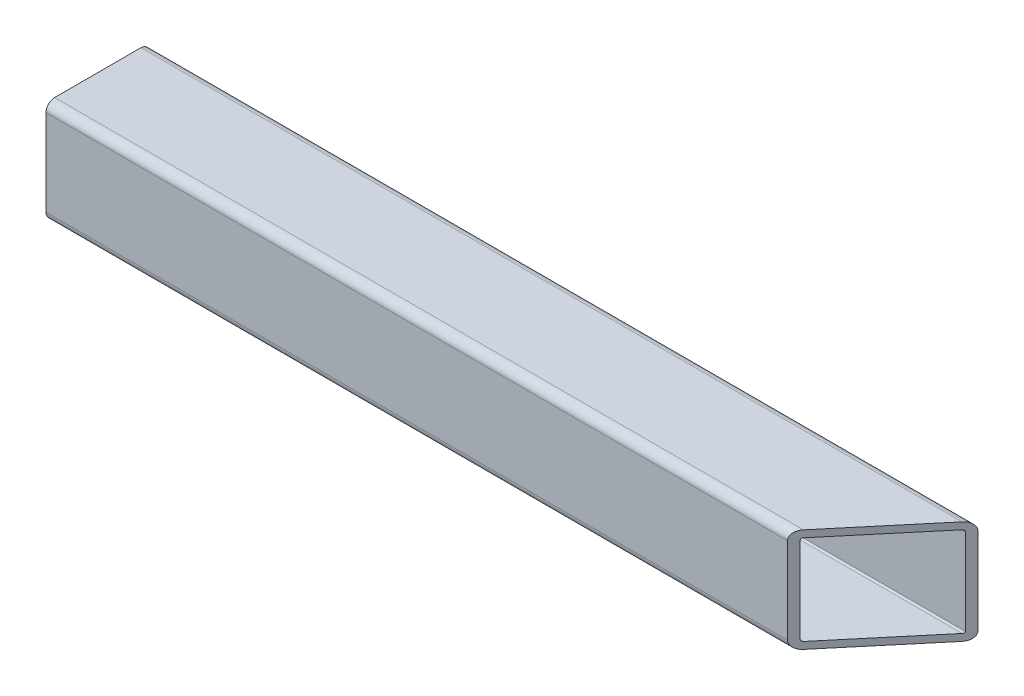
ISO-10303-21;
HEADER;
FILE_DESCRIPTION(('STEP AP214'),'2;1');
FILE_NAME('part.step','',(''),(''),'','','');
FILE_SCHEMA(('AUTOMOTIVE_DESIGN { 1 0 10303 214 1 1 1 1 }'));
ENDSEC;
DATA;
#1=APPLICATION_CONTEXT('core data for automotive mechanical design processes');
#2=APPLICATION_PROTOCOL_DEFINITION('international standard','automotive_design',2000,#1);
#3=PRODUCT_CONTEXT('',#1,'mechanical');
#4=PRODUCT('Part','Part','',(#3));
#5=PRODUCT_RELATED_PRODUCT_CATEGORY('part','',(#4));
#6=PRODUCT_DEFINITION_FORMATION('','',#4);
#7=PRODUCT_DEFINITION_CONTEXT('part definition',#1,'design');
#8=PRODUCT_DEFINITION('design','',#6,#7);
#9=PRODUCT_DEFINITION_SHAPE('','',#8);
#10=(LENGTH_UNIT() NAMED_UNIT(*) SI_UNIT(.MILLI.,.METRE.));
#11=(NAMED_UNIT(*) PLANE_ANGLE_UNIT() SI_UNIT($,.RADIAN.));
#12=(NAMED_UNIT(*) SI_UNIT($,.STERADIAN.) SOLID_ANGLE_UNIT());
#13=UNCERTAINTY_MEASURE_WITH_UNIT(LENGTH_MEASURE(1.E-05),#10,'distance_accuracy_value','');
#14=(GEOMETRIC_REPRESENTATION_CONTEXT(3) GLOBAL_UNCERTAINTY_ASSIGNED_CONTEXT((#13)) GLOBAL_UNIT_ASSIGNED_CONTEXT((#10,
#11,#12)) REPRESENTATION_CONTEXT('',''));
#15=CARTESIAN_POINT('',(0.,0.,0.));
#16=DIRECTION('',(0.,0.,1.));
#17=DIRECTION('',(1.,0.,0.));
#18=AXIS2_PLACEMENT_3D('',#15,#16,#17);
#19=CARTESIAN_POINT('',(152.4,-15.875,15.875));
#20=DIRECTION('',(-1.,0.,0.));
#21=DIRECTION('',(0.,0.,1.));
#22=AXIS2_PLACEMENT_3D('',#19,#20,#21);
#23=CYLINDRICAL_SURFACE('',#22,3.175);
#24=CARTESIAN_POINT('',(123.094445381133,-15.875,15.875));
#25=DIRECTION('',(0.766044443118977,0.,0.642787609686541));
#26=DIRECTION('',(-0.642787609686541,0.,0.766044443118977));
#27=AXIS2_PLACEMENT_3D('',#24,#25,#26);
#28=ELLIPSE('',#27,4.14466814363,3.175);
#29=CARTESIAN_POINT('',(120.430304052146,-15.8749999999999,19.05));
#30=VERTEX_POINT('',#29);
#31=CARTESIAN_POINT('',(123.094445381133,-19.05,15.875));
#32=VERTEX_POINT('',#31);
#33=EDGE_CURVE('E206',#30,#32,#28,.T.);
#34=ORIENTED_EDGE('',*,*,#33,.F.);
#35=DIRECTION('',(-1.,0.,0.));
#36=VECTOR('',#35,1.);
#37=CARTESIAN_POINT('',(152.4,-15.875,19.05));
#38=LINE('',#37,#36);
#39=CARTESIAN_POINT('',(-152.4,-15.875,19.05));
#40=VERTEX_POINT('',#39);
#41=EDGE_CURVE('E191',#30,#40,#38,.T.);
#42=ORIENTED_EDGE('',*,*,#41,.T.);
#43=CARTESIAN_POINT('',(-152.4,-15.875,15.875));
#44=DIRECTION('',(1.,0.,0.));
#45=DIRECTION('',(0.,0.,-1.));
#46=AXIS2_PLACEMENT_3D('',#43,#44,#45);
#47=CIRCLE('',#46,3.175);
#48=CARTESIAN_POINT('',(-152.4,-19.05,15.875));
#49=VERTEX_POINT('',#48);
#50=EDGE_CURVE('E284',#40,#49,#47,.T.);
#51=ORIENTED_EDGE('',*,*,#50,.T.);
#52=DIRECTION('',(-1.,0.,0.));
#53=VECTOR('',#52,1.);
#54=CARTESIAN_POINT('',(152.4,-19.05,15.875));
#55=LINE('',#54,#53);
#56=EDGE_CURVE('E87',#32,#49,#55,.T.);
#57=ORIENTED_EDGE('',*,*,#56,.F.);
#58=EDGE_LOOP('',(#34,#42,#51,#57));
#59=FACE_BOUND('',#58,.T.);
#60=ADVANCED_FACE('F80',(#59),#23,.T.);
#61=CARTESIAN_POINT('',(152.4,-19.05,15.875));
#62=DIRECTION('',(0.,1.,0.));
#63=DIRECTION('',(0.,0.,1.));
#64=AXIS2_PLACEMENT_3D('',#61,#62,#63);
#65=PLANE('',#64);
#66=DIRECTION('',(0.642787609686541,0.,-0.766044443118977));
#67=VECTOR('',#66,1.);
#68=CARTESIAN_POINT('',(135.202794613024,-19.05,1.44483130250871));
#69=LINE('',#68,#67);
#70=CARTESIAN_POINT('',(149.735858671012,-19.05,-15.875));
#71=VERTEX_POINT('',#70);
#72=EDGE_CURVE('E94',#32,#71,#69,.T.);
#73=ORIENTED_EDGE('',*,*,#72,.F.);
#74=ORIENTED_EDGE('',*,*,#56,.T.);
#75=DIRECTION('',(0.,0.,-1.));
#76=VECTOR('',#75,1.);
#77=CARTESIAN_POINT('',(-152.4,-19.05,15.875));
#78=LINE('',#77,#76);
#79=CARTESIAN_POINT('',(-152.4,-19.05,-15.875));
#80=VERTEX_POINT('',#79);
#81=EDGE_CURVE('E288',#49,#80,#78,.T.);
#82=ORIENTED_EDGE('',*,*,#81,.T.);
#83=DIRECTION('',(-1.,0.,0.));
#84=VECTOR('',#83,1.);
#85=CARTESIAN_POINT('',(152.4,-19.05,-15.875));
#86=LINE('',#85,#84);
#87=EDGE_CURVE('E316',#71,#80,#86,.T.);
#88=ORIENTED_EDGE('',*,*,#87,.F.);
#89=EDGE_LOOP('',(#73,#74,#82,#88));
#90=FACE_BOUND('',#89,.T.);
#91=ADVANCED_FACE('F318',(#90),#65,.F.);
#92=CARTESIAN_POINT('',(152.4,-15.875,-15.875));
#93=DIRECTION('',(-1.,0.,0.));
#94=DIRECTION('',(0.,0.,1.));
#95=AXIS2_PLACEMENT_3D('',#92,#93,#94);
#96=CYLINDRICAL_SURFACE('',#95,3.175);
#97=CARTESIAN_POINT('',(149.735858671012,-15.875,-15.875));
#98=DIRECTION('',(0.766044443118977,0.,0.642787609686541));
#99=DIRECTION('',(-0.642787609686541,0.,0.766044443118977));
#100=AXIS2_PLACEMENT_3D('',#97,#98,#99);
#101=ELLIPSE('',#100,4.14466814362999,3.175);
#102=CARTESIAN_POINT('',(152.4,-15.875,-19.05));
#103=VERTEX_POINT('',#102);
#104=EDGE_CURVE('E102',#71,#103,#101,.T.);
#105=ORIENTED_EDGE('',*,*,#104,.F.);
#106=ORIENTED_EDGE('',*,*,#87,.T.);
#107=CARTESIAN_POINT('',(-152.4,-15.875,-15.875));
#108=DIRECTION('',(1.,0.,0.));
#109=DIRECTION('',(0.,0.,-1.));
#110=AXIS2_PLACEMENT_3D('',#107,#108,#109);
#111=CIRCLE('',#110,3.175);
#112=CARTESIAN_POINT('',(-152.4,-15.875,-19.05));
#113=VERTEX_POINT('',#112);
#114=EDGE_CURVE('E291',#80,#113,#111,.T.);
#115=ORIENTED_EDGE('',*,*,#114,.T.);
#116=DIRECTION('',(-1.,0.,0.));
#117=VECTOR('',#116,1.);
#118=CARTESIAN_POINT('',(152.4,-15.875,-19.05));
#119=LINE('',#118,#117);
#120=EDGE_CURVE('E313',#103,#113,#119,.T.);
#121=ORIENTED_EDGE('',*,*,#120,.F.);
#122=EDGE_LOOP('',(#105,#106,#115,#121));
#123=FACE_BOUND('',#122,.T.);
#124=ADVANCED_FACE('F325',(#123),#96,.T.);
#125=CARTESIAN_POINT('',(152.4,15.875,-15.875));
#126=DIRECTION('',(-1.,0.,0.));
#127=DIRECTION('',(0.,0.,1.));
#128=AXIS2_PLACEMENT_3D('',#125,#126,#127);
#129=CYLINDRICAL_SURFACE('',#128,3.175);
#130=CARTESIAN_POINT('',(149.735858671012,15.875,-15.875));
#131=DIRECTION('',(0.766044443118977,0.,0.642787609686541));
#132=DIRECTION('',(-0.642787609686541,0.,0.766044443118977));
#133=AXIS2_PLACEMENT_3D('',#130,#131,#132);
#134=ELLIPSE('',#133,4.14466814363,3.175);
#135=CARTESIAN_POINT('',(152.4,15.875,-19.05));
#136=VERTEX_POINT('',#135);
#137=CARTESIAN_POINT('',(149.735858671012,19.05,-15.875));
#138=VERTEX_POINT('',#137);
#139=EDGE_CURVE('E240',#136,#138,#134,.T.);
#140=ORIENTED_EDGE('',*,*,#139,.F.);
#141=DIRECTION('',(-1.,0.,0.));
#142=VECTOR('',#141,1.);
#143=CARTESIAN_POINT('',(152.4,15.875,-19.05));
#144=LINE('',#143,#142);
#145=CARTESIAN_POINT('',(-152.4,15.875,-19.05));
#146=VERTEX_POINT('',#145);
#147=EDGE_CURVE('E310',#136,#146,#144,.T.);
#148=ORIENTED_EDGE('',*,*,#147,.T.);
#149=CARTESIAN_POINT('',(-152.4,15.875,-15.875));
#150=DIRECTION('',(1.,0.,0.));
#151=DIRECTION('',(0.,0.,-1.));
#152=AXIS2_PLACEMENT_3D('',#149,#150,#151);
#153=CIRCLE('',#152,3.175);
#154=CARTESIAN_POINT('',(-152.4,19.05,-15.875));
#155=VERTEX_POINT('',#154);
#156=EDGE_CURVE('E295',#146,#155,#153,.T.);
#157=ORIENTED_EDGE('',*,*,#156,.T.);
#158=DIRECTION('',(-1.,0.,0.));
#159=VECTOR('',#158,1.);
#160=CARTESIAN_POINT('',(152.4,19.05,-15.875));
#161=LINE('',#160,#159);
#162=EDGE_CURVE('E308',#138,#155,#161,.T.);
#163=ORIENTED_EDGE('',*,*,#162,.F.);
#164=EDGE_LOOP('',(#140,#148,#157,#163));
#165=FACE_BOUND('',#164,.T.);
#166=ADVANCED_FACE('F332',(#165),#129,.T.);
#167=CARTESIAN_POINT('',(152.4,19.05,15.875));
#168=DIRECTION('',(0.,-1.,0.));
#169=DIRECTION('',(0.,0.,-1.));
#170=AXIS2_PLACEMENT_3D('',#167,#168,#169);
#171=PLANE('',#170);
#172=DIRECTION('',(-0.642787609686541,0.,0.766044443118977));
#173=VECTOR('',#172,1.);
#174=CARTESIAN_POINT('',(135.202794613024,19.05,1.44483130250871));
#175=LINE('',#174,#173);
#176=CARTESIAN_POINT('',(123.094445381133,19.05,15.875));
#177=VERTEX_POINT('',#176);
#178=EDGE_CURVE('E238',#138,#177,#175,.T.);
#179=ORIENTED_EDGE('',*,*,#178,.F.);
#180=ORIENTED_EDGE('',*,*,#162,.T.);
#181=DIRECTION('',(0.,0.,1.));
#182=VECTOR('',#181,1.);
#183=CARTESIAN_POINT('',(-152.4,19.05,15.875));
#184=LINE('',#183,#182);
#185=CARTESIAN_POINT('',(-152.4,19.05,15.875));
#186=VERTEX_POINT('',#185);
#187=EDGE_CURVE('E298',#155,#186,#184,.T.);
#188=ORIENTED_EDGE('',*,*,#187,.T.);
#189=DIRECTION('',(-1.,0.,0.));
#190=VECTOR('',#189,1.);
#191=CARTESIAN_POINT('',(152.4,19.05,15.875));
#192=LINE('',#191,#190);
#193=EDGE_CURVE('E306',#177,#186,#192,.T.);
#194=ORIENTED_EDGE('',*,*,#193,.F.);
#195=EDGE_LOOP('',(#179,#180,#188,#194));
#196=FACE_BOUND('',#195,.T.);
#197=ADVANCED_FACE('F335',(#196),#171,.F.);
#198=CARTESIAN_POINT('',(152.4,15.875,15.875));
#199=DIRECTION('',(-1.,0.,0.));
#200=DIRECTION('',(0.,0.,1.));
#201=AXIS2_PLACEMENT_3D('',#198,#199,#200);
#202=CYLINDRICAL_SURFACE('',#201,3.175);
#203=CARTESIAN_POINT('',(123.094445381133,15.875,15.875));
#204=DIRECTION('',(0.766044443118977,0.,0.642787609686541));
#205=DIRECTION('',(-0.642787609686541,0.,0.766044443118977));
#206=AXIS2_PLACEMENT_3D('',#203,#204,#205);
#207=ELLIPSE('',#206,4.14466814363,3.175);
#208=CARTESIAN_POINT('',(120.430304052146,15.875,19.05));
#209=VERTEX_POINT('',#208);
#210=EDGE_CURVE('E213',#177,#209,#207,.T.);
#211=ORIENTED_EDGE('',*,*,#210,.F.);
#212=ORIENTED_EDGE('',*,*,#193,.T.);
#213=CARTESIAN_POINT('',(-152.4,15.875,15.875));
#214=DIRECTION('',(1.,0.,0.));
#215=DIRECTION('',(0.,0.,-1.));
#216=AXIS2_PLACEMENT_3D('',#213,#214,#215);
#217=CIRCLE('',#216,3.175);
#218=CARTESIAN_POINT('',(-152.4,15.875,19.05));
#219=VERTEX_POINT('',#218);
#220=EDGE_CURVE('E301',#186,#219,#217,.T.);
#221=ORIENTED_EDGE('',*,*,#220,.T.);
#222=DIRECTION('',(-1.,0.,0.));
#223=VECTOR('',#222,1.);
#224=CARTESIAN_POINT('',(152.4,15.875,19.05));
#225=LINE('',#224,#223);
#226=EDGE_CURVE('E202',#209,#219,#225,.T.);
#227=ORIENTED_EDGE('',*,*,#226,.F.);
#228=EDGE_LOOP('',(#211,#212,#221,#227));
#229=FACE_BOUND('',#228,.T.);
#230=ADVANCED_FACE('F339',(#229),#202,.T.);
#231=CARTESIAN_POINT('',(152.4,15.875,19.05));
#232=DIRECTION('',(0.,0.,-1.));
#233=DIRECTION('',(0.,1.,0.));
#234=AXIS2_PLACEMENT_3D('',#231,#232,#233);
#235=PLANE('',#234);
#236=DIRECTION('',(0.,-1.,0.));
#237=VECTOR('',#236,1.);
#238=CARTESIAN_POINT('',(120.430304052146,453.582329020788,19.05));
#239=LINE('',#238,#237);
#240=EDGE_CURVE('E195',#209,#30,#239,.T.);
#241=ORIENTED_EDGE('',*,*,#240,.F.);
#242=ORIENTED_EDGE('',*,*,#226,.T.);
#243=DIRECTION('',(0.,-1.,0.));
#244=VECTOR('',#243,1.);
#245=CARTESIAN_POINT('',(-152.4,15.875,19.05));
#246=LINE('',#245,#244);
#247=EDGE_CURVE('E198',#219,#40,#246,.T.);
#248=ORIENTED_EDGE('',*,*,#247,.T.);
#249=ORIENTED_EDGE('',*,*,#41,.F.);
#250=EDGE_LOOP('',(#241,#242,#248,#249));
#251=FACE_BOUND('',#250,.T.);
#252=ADVANCED_FACE('F193',(#251),#235,.F.);
#253=CARTESIAN_POINT('',(152.4,-15.875,15.875));
#254=DIRECTION('',(-1.,0.,0.));
#255=DIRECTION('',(0.,0.,1.));
#256=AXIS2_PLACEMENT_3D('',#253,#254,#255);
#257=CYLINDRICAL_SURFACE('',#256,0.635000000000002);
#258=DIRECTION('',(-1.,0.,0.));
#259=VECTOR('',#258,1.);
#260=CARTESIAN_POINT('',(152.4,-15.875,16.51));
#261=LINE('',#260,#259);
#262=CARTESIAN_POINT('',(122.561617115336,-15.875,16.51));
#263=VERTEX_POINT('',#262);
#264=CARTESIAN_POINT('',(-152.4,-15.875,16.51));
#265=VERTEX_POINT('',#264);
#266=EDGE_CURVE('E268',#263,#265,#261,.T.);
#267=ORIENTED_EDGE('',*,*,#266,.F.);
#268=CARTESIAN_POINT('',(123.094445381133,-15.875,15.875));
#269=DIRECTION('',(0.766044443118977,0.,0.642787609686541));
#270=DIRECTION('',(-0.642787609686541,0.,0.766044443118977));
#271=AXIS2_PLACEMENT_3D('',#268,#269,#270);
#272=ELLIPSE('',#271,0.828933628726001,0.635000000000002);
#273=CARTESIAN_POINT('',(123.094445381133,-16.51,15.875));
#274=VERTEX_POINT('',#273);
#275=EDGE_CURVE('E234',#263,#274,#272,.T.);
#276=ORIENTED_EDGE('',*,*,#275,.T.);
#277=DIRECTION('',(-1.,0.,0.));
#278=VECTOR('',#277,1.);
#279=CARTESIAN_POINT('',(152.4,-16.51,15.875));
#280=LINE('',#279,#278);
#281=CARTESIAN_POINT('',(-152.4,-16.51,15.875));
#282=VERTEX_POINT('',#281);
#283=EDGE_CURVE('E282',#274,#282,#280,.T.);
#284=ORIENTED_EDGE('',*,*,#283,.T.);
#285=CARTESIAN_POINT('',(-152.4,-15.875,15.875));
#286=DIRECTION('',(1.,0.,0.));
#287=DIRECTION('',(0.,0.,-1.));
#288=AXIS2_PLACEMENT_3D('',#285,#286,#287);
#289=CIRCLE('',#288,0.635000000000002);
#290=EDGE_CURVE('E208',#265,#282,#289,.T.);
#291=ORIENTED_EDGE('',*,*,#290,.F.);
#292=EDGE_LOOP('',(#267,#276,#284,#291));
#293=FACE_BOUND('',#292,.T.);
#294=ADVANCED_FACE('F346',(#293),#257,.F.);
#295=CARTESIAN_POINT('',(152.4,-16.51,15.875));
#296=DIRECTION('',(0.,1.,0.));
#297=DIRECTION('',(0.,0.,1.));
#298=AXIS2_PLACEMENT_3D('',#295,#296,#297);
#299=PLANE('',#298);
#300=ORIENTED_EDGE('',*,*,#283,.F.);
#301=DIRECTION('',(0.642787609686541,0.,-0.766044443118977));
#302=VECTOR('',#301,1.);
#303=CARTESIAN_POINT('',(135.202794613024,-16.51,1.44483130250871));
#304=LINE('',#303,#302);
#305=CARTESIAN_POINT('',(149.735858671012,-16.51,-15.875));
#306=VERTEX_POINT('',#305);
#307=EDGE_CURVE('E231',#274,#306,#304,.T.);
#308=ORIENTED_EDGE('',*,*,#307,.T.);
#309=DIRECTION('',(-1.,0.,0.));
#310=VECTOR('',#309,1.);
#311=CARTESIAN_POINT('',(152.4,-16.51,-15.875));
#312=LINE('',#311,#310);
#313=CARTESIAN_POINT('',(-152.4,-16.51,-15.875));
#314=VERTEX_POINT('',#313);
#315=EDGE_CURVE('E280',#306,#314,#312,.T.);
#316=ORIENTED_EDGE('',*,*,#315,.T.);
#317=DIRECTION('',(0.,0.,-1.));
#318=VECTOR('',#317,1.);
#319=CARTESIAN_POINT('',(-152.4,-16.51,15.875));
#320=LINE('',#319,#318);
#321=EDGE_CURVE('E247',#282,#314,#320,.T.);
#322=ORIENTED_EDGE('',*,*,#321,.F.);
#323=EDGE_LOOP('',(#300,#308,#316,#322));
#324=FACE_BOUND('',#323,.T.);
#325=ADVANCED_FACE('F388',(#324),#299,.T.);
#326=CARTESIAN_POINT('',(152.4,-15.875,-15.875));
#327=DIRECTION('',(-1.,0.,0.));
#328=DIRECTION('',(0.,0.,1.));
#329=AXIS2_PLACEMENT_3D('',#326,#327,#328);
#330=CYLINDRICAL_SURFACE('',#329,0.634999999999999);
#331=ORIENTED_EDGE('',*,*,#315,.F.);
#332=CARTESIAN_POINT('',(149.735858671012,-15.875,-15.875));
#333=DIRECTION('',(0.766044443118977,0.,0.642787609686541));
#334=DIRECTION('',(-0.642787609686541,0.,0.766044443118977));
#335=AXIS2_PLACEMENT_3D('',#332,#333,#334);
#336=ELLIPSE('',#335,0.828933628725997,0.634999999999999);
#337=CARTESIAN_POINT('',(150.26868693681,-15.875,-16.51));
#338=VERTEX_POINT('',#337);
#339=EDGE_CURVE('E228',#306,#338,#336,.T.);
#340=ORIENTED_EDGE('',*,*,#339,.T.);
#341=DIRECTION('',(-1.,0.,0.));
#342=VECTOR('',#341,1.);
#343=CARTESIAN_POINT('',(152.4,-15.875,-16.51));
#344=LINE('',#343,#342);
#345=CARTESIAN_POINT('',(-152.4,-15.875,-16.51));
#346=VERTEX_POINT('',#345);
#347=EDGE_CURVE('E278',#338,#346,#344,.T.);
#348=ORIENTED_EDGE('',*,*,#347,.T.);
#349=CARTESIAN_POINT('',(-152.4,-15.875,-15.875));
#350=DIRECTION('',(1.,0.,0.));
#351=DIRECTION('',(0.,0.,-1.));
#352=AXIS2_PLACEMENT_3D('',#349,#350,#351);
#353=CIRCLE('',#352,0.634999999999999);
#354=EDGE_CURVE('E250',#314,#346,#353,.T.);
#355=ORIENTED_EDGE('',*,*,#354,.F.);
#356=EDGE_LOOP('',(#331,#340,#348,#355));
#357=FACE_BOUND('',#356,.T.);
#358=ADVANCED_FACE('F398',(#357),#330,.F.);
#359=CARTESIAN_POINT('',(152.4,15.875,-16.51));
#360=DIRECTION('',(0.,0.,1.));
#361=DIRECTION('',(0.,-1.,0.));
#362=AXIS2_PLACEMENT_3D('',#359,#360,#361);
#363=PLANE('',#362);
#364=ORIENTED_EDGE('',*,*,#347,.F.);
#365=DIRECTION('',(0.,1.,0.));
#366=VECTOR('',#365,1.);
#367=CARTESIAN_POINT('',(150.26868693681,15.875,-16.51));
#368=LINE('',#367,#366);
#369=CARTESIAN_POINT('',(150.26868693681,15.875,-16.51));
#370=VERTEX_POINT('',#369);
#371=EDGE_CURVE('E225',#338,#370,#368,.T.);
#372=ORIENTED_EDGE('',*,*,#371,.T.);
#373=DIRECTION('',(-1.,0.,0.));
#374=VECTOR('',#373,1.);
#375=CARTESIAN_POINT('',(152.4,15.875,-16.51));
#376=LINE('',#375,#374);
#377=CARTESIAN_POINT('',(-152.4,15.875,-16.51));
#378=VERTEX_POINT('',#377);
#379=EDGE_CURVE('E276',#370,#378,#376,.T.);
#380=ORIENTED_EDGE('',*,*,#379,.T.);
#381=DIRECTION('',(0.,1.,0.));
#382=VECTOR('',#381,1.);
#383=CARTESIAN_POINT('',(-152.4,15.875,-16.51));
#384=LINE('',#383,#382);
#385=EDGE_CURVE('E253',#346,#378,#384,.T.);
#386=ORIENTED_EDGE('',*,*,#385,.F.);
#387=EDGE_LOOP('',(#364,#372,#380,#386));
#388=FACE_BOUND('',#387,.T.);
#389=ADVANCED_FACE('F408',(#388),#363,.T.);
#390=CARTESIAN_POINT('',(152.4,15.875,-15.875));
#391=DIRECTION('',(-1.,0.,0.));
#392=DIRECTION('',(0.,0.,1.));
#393=AXIS2_PLACEMENT_3D('',#390,#391,#392);
#394=CYLINDRICAL_SURFACE('',#393,0.635000000000004);
#395=ORIENTED_EDGE('',*,*,#379,.F.);
#396=CARTESIAN_POINT('',(149.735858671012,15.875,-15.875));
#397=DIRECTION('',(0.766044443118977,0.,0.642787609686541));
#398=DIRECTION('',(-0.642787609686541,0.,0.766044443118977));
#399=AXIS2_PLACEMENT_3D('',#396,#397,#398);
#400=ELLIPSE('',#399,0.828933628726004,0.635000000000004);
#401=CARTESIAN_POINT('',(149.735858671012,16.51,-15.875));
#402=VERTEX_POINT('',#401);
#403=EDGE_CURVE('E222',#370,#402,#400,.T.);
#404=ORIENTED_EDGE('',*,*,#403,.T.);
#405=DIRECTION('',(-1.,0.,0.));
#406=VECTOR('',#405,1.);
#407=CARTESIAN_POINT('',(152.4,16.51,-15.875));
#408=LINE('',#407,#406);
#409=CARTESIAN_POINT('',(-152.4,16.51,-15.875));
#410=VERTEX_POINT('',#409);
#411=EDGE_CURVE('E274',#402,#410,#408,.T.);
#412=ORIENTED_EDGE('',*,*,#411,.T.);
#413=CARTESIAN_POINT('',(-152.4,15.875,-15.875));
#414=DIRECTION('',(1.,0.,0.));
#415=DIRECTION('',(0.,0.,-1.));
#416=AXIS2_PLACEMENT_3D('',#413,#414,#415);
#417=CIRCLE('',#416,0.635000000000004);
#418=EDGE_CURVE('E256',#378,#410,#417,.T.);
#419=ORIENTED_EDGE('',*,*,#418,.F.);
#420=EDGE_LOOP('',(#395,#404,#412,#419));
#421=FACE_BOUND('',#420,.T.);
#422=ADVANCED_FACE('F418',(#421),#394,.F.);
#423=CARTESIAN_POINT('',(152.4,16.51,15.875));
#424=DIRECTION('',(0.,-1.,0.));
#425=DIRECTION('',(0.,0.,-1.));
#426=AXIS2_PLACEMENT_3D('',#423,#424,#425);
#427=PLANE('',#426);
#428=ORIENTED_EDGE('',*,*,#411,.F.);
#429=DIRECTION('',(-0.642787609686541,0.,0.766044443118977));
#430=VECTOR('',#429,1.);
#431=CARTESIAN_POINT('',(135.202794613024,16.51,1.44483130250871));
#432=LINE('',#431,#430);
#433=CARTESIAN_POINT('',(123.094445381133,16.51,15.875));
#434=VERTEX_POINT('',#433);
#435=EDGE_CURVE('E217',#402,#434,#432,.T.);
#436=ORIENTED_EDGE('',*,*,#435,.T.);
#437=DIRECTION('',(-1.,0.,0.));
#438=VECTOR('',#437,1.);
#439=CARTESIAN_POINT('',(152.4,16.51,15.875));
#440=LINE('',#439,#438);
#441=CARTESIAN_POINT('',(-152.4,16.51,15.875));
#442=VERTEX_POINT('',#441);
#443=EDGE_CURVE('E272',#434,#442,#440,.T.);
#444=ORIENTED_EDGE('',*,*,#443,.T.);
#445=DIRECTION('',(0.,0.,1.));
#446=VECTOR('',#445,1.);
#447=CARTESIAN_POINT('',(-152.4,16.51,15.875));
#448=LINE('',#447,#446);
#449=EDGE_CURVE('E259',#410,#442,#448,.T.);
#450=ORIENTED_EDGE('',*,*,#449,.F.);
#451=EDGE_LOOP('',(#428,#436,#444,#450));
#452=FACE_BOUND('',#451,.T.);
#453=ADVANCED_FACE('F428',(#452),#427,.T.);
#454=CARTESIAN_POINT('',(152.4,15.875,15.875));
#455=DIRECTION('',(-1.,0.,0.));
#456=DIRECTION('',(0.,0.,1.));
#457=AXIS2_PLACEMENT_3D('',#454,#455,#456);
#458=CYLINDRICAL_SURFACE('',#457,0.635000000000004);
#459=ORIENTED_EDGE('',*,*,#443,.F.);
#460=CARTESIAN_POINT('',(123.094445381133,15.875,15.875));
#461=DIRECTION('',(0.766044443118977,0.,0.642787609686541));
#462=DIRECTION('',(-0.642787609686541,0.,0.766044443118977));
#463=AXIS2_PLACEMENT_3D('',#460,#461,#462);
#464=ELLIPSE('',#463,0.828933628726004,0.635000000000004);
#465=CARTESIAN_POINT('',(122.561617115336,15.875,16.51));
#466=VERTEX_POINT('',#465);
#467=EDGE_CURVE('E214',#434,#466,#464,.T.);
#468=ORIENTED_EDGE('',*,*,#467,.T.);
#469=DIRECTION('',(-1.,0.,0.));
#470=VECTOR('',#469,1.);
#471=CARTESIAN_POINT('',(152.4,15.875,16.51));
#472=LINE('',#471,#470);
#473=CARTESIAN_POINT('',(-152.4,15.875,16.51));
#474=VERTEX_POINT('',#473);
#475=EDGE_CURVE('E270',#466,#474,#472,.T.);
#476=ORIENTED_EDGE('',*,*,#475,.T.);
#477=CARTESIAN_POINT('',(-152.4,15.875,15.875));
#478=DIRECTION('',(1.,0.,0.));
#479=DIRECTION('',(0.,0.,-1.));
#480=AXIS2_PLACEMENT_3D('',#477,#478,#479);
#481=CIRCLE('',#480,0.635000000000004);
#482=EDGE_CURVE('E262',#442,#474,#481,.T.);
#483=ORIENTED_EDGE('',*,*,#482,.F.);
#484=EDGE_LOOP('',(#459,#468,#476,#483));
#485=FACE_BOUND('',#484,.T.);
#486=ADVANCED_FACE('F438',(#485),#458,.F.);
#487=CARTESIAN_POINT('',(152.4,15.875,16.51));
#488=DIRECTION('',(0.,0.,-1.));
#489=DIRECTION('',(0.,1.,0.));
#490=AXIS2_PLACEMENT_3D('',#487,#488,#489);
#491=PLANE('',#490);
#492=ORIENTED_EDGE('',*,*,#475,.F.);
#493=DIRECTION('',(0.,-1.,0.));
#494=VECTOR('',#493,1.);
#495=CARTESIAN_POINT('',(122.561617115336,15.875,16.51));
#496=LINE('',#495,#494);
#497=EDGE_CURVE('E12',#466,#263,#496,.T.);
#498=ORIENTED_EDGE('',*,*,#497,.T.);
#499=ORIENTED_EDGE('',*,*,#266,.T.);
#500=DIRECTION('',(0.,-1.,0.));
#501=VECTOR('',#500,1.);
#502=CARTESIAN_POINT('',(-152.4,15.875,16.51));
#503=LINE('',#502,#501);
#504=EDGE_CURVE('E265',#474,#265,#503,.T.);
#505=ORIENTED_EDGE('',*,*,#504,.F.);
#506=EDGE_LOOP('',(#492,#498,#499,#505));
#507=FACE_BOUND('',#506,.T.);
#508=ADVANCED_FACE('F448',(#507),#491,.T.);
#509=CARTESIAN_POINT('',(-152.4,-15.875,15.875));
#510=DIRECTION('',(1.,0.,0.));
#511=DIRECTION('',(0.,0.,-1.));
#512=AXIS2_PLACEMENT_3D('',#509,#510,#511);
#513=PLANE('',#512);
#514=ORIENTED_EDGE('',*,*,#50,.F.);
#515=ORIENTED_EDGE('',*,*,#247,.F.);
#516=ORIENTED_EDGE('',*,*,#220,.F.);
#517=ORIENTED_EDGE('',*,*,#187,.F.);
#518=ORIENTED_EDGE('',*,*,#156,.F.);
#519=DIRECTION('',(0.,1.,0.));
#520=VECTOR('',#519,1.);
#521=CARTESIAN_POINT('',(-152.4,15.875,-19.05));
#522=LINE('',#521,#520);
#523=EDGE_CURVE('E293',#113,#146,#522,.T.);
#524=ORIENTED_EDGE('',*,*,#523,.F.);
#525=ORIENTED_EDGE('',*,*,#114,.F.);
#526=ORIENTED_EDGE('',*,*,#81,.F.);
#527=EDGE_LOOP('',(#514,#515,#516,#517,#518,#524,#525,#526));
#528=FACE_BOUND('',#527,.T.);
#529=ORIENTED_EDGE('',*,*,#290,.T.);
#530=ORIENTED_EDGE('',*,*,#321,.T.);
#531=ORIENTED_EDGE('',*,*,#354,.T.);
#532=ORIENTED_EDGE('',*,*,#385,.T.);
#533=ORIENTED_EDGE('',*,*,#418,.T.);
#534=ORIENTED_EDGE('',*,*,#449,.T.);
#535=ORIENTED_EDGE('',*,*,#482,.T.);
#536=ORIENTED_EDGE('',*,*,#504,.T.);
#537=EDGE_LOOP('',(#529,#530,#531,#532,#533,#534,#535,#536));
#538=FACE_BOUND('',#537,.T.);
#539=ADVANCED_FACE('F321',(#528,#538),#513,.F.);
#540=CARTESIAN_POINT('',(152.4,15.875,-19.05));
#541=DIRECTION('',(0.,0.,1.));
#542=DIRECTION('',(0.,-1.,0.));
#543=AXIS2_PLACEMENT_3D('',#540,#541,#542);
#544=PLANE('',#543);
#545=ORIENTED_EDGE('',*,*,#523,.T.);
#546=ORIENTED_EDGE('',*,*,#147,.F.);
#547=DIRECTION('',(0.,1.,0.));
#548=VECTOR('',#547,1.);
#549=CARTESIAN_POINT('',(152.4,15.875,-19.05));
#550=LINE('',#549,#548);
#551=EDGE_CURVE('E203',#103,#136,#550,.T.);
#552=ORIENTED_EDGE('',*,*,#551,.F.);
#553=ORIENTED_EDGE('',*,*,#120,.T.);
#554=EDGE_LOOP('',(#545,#546,#552,#553));
#555=FACE_BOUND('',#554,.T.);
#556=ADVANCED_FACE('F328',(#555),#544,.F.);
#557=CARTESIAN_POINT('',(152.4,453.582329020788,-19.05));
#558=DIRECTION('',(0.766044443118977,0.,0.642787609686541));
#559=DIRECTION('',(0.642787609686541,0.,-0.766044443118977));
#560=AXIS2_PLACEMENT_3D('',#557,#558,#559);
#561=PLANE('',#560);
#562=ORIENTED_EDGE('',*,*,#275,.F.);
#563=ORIENTED_EDGE('',*,*,#497,.F.);
#564=ORIENTED_EDGE('',*,*,#467,.F.);
#565=ORIENTED_EDGE('',*,*,#435,.F.);
#566=ORIENTED_EDGE('',*,*,#403,.F.);
#567=ORIENTED_EDGE('',*,*,#371,.F.);
#568=ORIENTED_EDGE('',*,*,#339,.F.);
#569=ORIENTED_EDGE('',*,*,#307,.F.);
#570=EDGE_LOOP('',(#562,#563,#564,#565,#566,#567,#568,#569));
#571=FACE_BOUND('',#570,.T.);
#572=ORIENTED_EDGE('',*,*,#240,.T.);
#573=ORIENTED_EDGE('',*,*,#33,.T.);
#574=ORIENTED_EDGE('',*,*,#72,.T.);
#575=ORIENTED_EDGE('',*,*,#104,.T.);
#576=ORIENTED_EDGE('',*,*,#551,.T.);
#577=ORIENTED_EDGE('',*,*,#139,.T.);
#578=ORIENTED_EDGE('',*,*,#178,.T.);
#579=ORIENTED_EDGE('',*,*,#210,.T.);
#580=EDGE_LOOP('',(#572,#573,#574,#575,#576,#577,#578,#579));
#581=FACE_BOUND('',#580,.T.);
#582=ADVANCED_FACE('F211',(#571,#581),#561,.T.);
#583=CLOSED_SHELL('',(#60,#91,#124,#166,#197,#230,#252,#294,#325,#358,#389,#422,#453,#486,#508,
#539,#556,#582));
#584=MANIFOLD_SOLID_BREP('B2',#583);
#585=ADVANCED_BREP_SHAPE_REPRESENTATION('',(#18,#584),#14);
#586=SHAPE_DEFINITION_REPRESENTATION(#9,#585);
ENDSEC;
END-ISO-10303-21;
